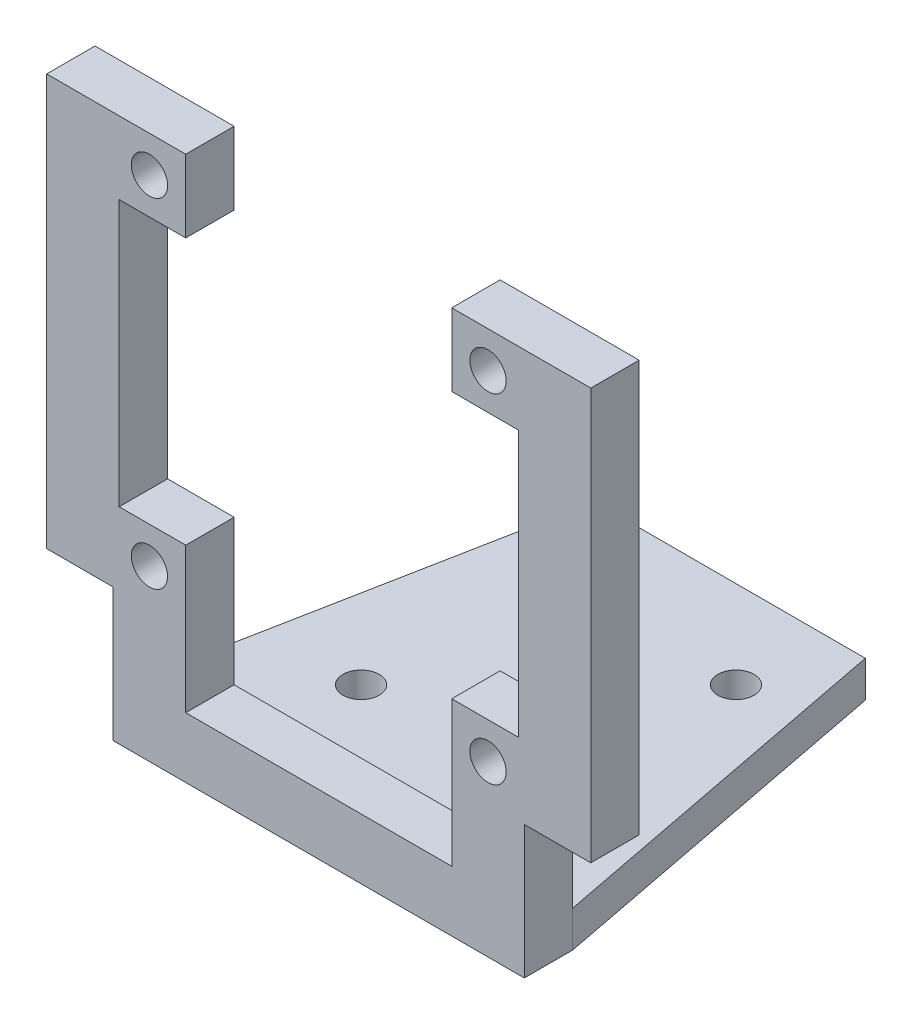
ISO-10303-21;
HEADER;
FILE_DESCRIPTION(('STEP AP214'),'2;1');
FILE_NAME('part.step','',(''),(''),'','','');
FILE_SCHEMA(('AUTOMOTIVE_DESIGN { 1 0 10303 214 1 1 1 1 }'));
ENDSEC;
DATA;
#1=APPLICATION_CONTEXT('core data for automotive mechanical design processes');
#2=APPLICATION_PROTOCOL_DEFINITION('international standard','automotive_design',2000,#1);
#3=PRODUCT_CONTEXT('',#1,'mechanical');
#4=PRODUCT('Part','Part','',(#3));
#5=PRODUCT_RELATED_PRODUCT_CATEGORY('part','',(#4));
#6=PRODUCT_DEFINITION_FORMATION('','',#4);
#7=PRODUCT_DEFINITION_CONTEXT('part definition',#1,'design');
#8=PRODUCT_DEFINITION('design','',#6,#7);
#9=PRODUCT_DEFINITION_SHAPE('','',#8);
#10=(LENGTH_UNIT() NAMED_UNIT(*) SI_UNIT(.MILLI.,.METRE.));
#11=(NAMED_UNIT(*) PLANE_ANGLE_UNIT() SI_UNIT($,.RADIAN.));
#12=(NAMED_UNIT(*) SI_UNIT($,.STERADIAN.) SOLID_ANGLE_UNIT());
#13=UNCERTAINTY_MEASURE_WITH_UNIT(LENGTH_MEASURE(1.E-05),#10,'distance_accuracy_value','');
#14=(GEOMETRIC_REPRESENTATION_CONTEXT(3) GLOBAL_UNCERTAINTY_ASSIGNED_CONTEXT((#13)) GLOBAL_UNIT_ASSIGNED_CONTEXT((#10,
#11,#12)) REPRESENTATION_CONTEXT('',''));
#15=CARTESIAN_POINT('',(0.,0.,0.));
#16=DIRECTION('',(0.,0.,1.));
#17=DIRECTION('',(1.,0.,0.));
#18=AXIS2_PLACEMENT_3D('',#15,#16,#17);
#19=CARTESIAN_POINT('',(0.,0.,0.));
#20=DIRECTION('',(0.,0.,1.));
#21=DIRECTION('',(1.,0.,0.));
#22=AXIS2_PLACEMENT_3D('',#19,#20,#21);
#23=PLANE('',#22);
#24=CARTESIAN_POINT('',(-14.,14.,0.));
#25=DIRECTION('',(0.,0.,1.));
#26=DIRECTION('',(1.,0.,0.));
#27=AXIS2_PLACEMENT_3D('',#24,#25,#26);
#28=CIRCLE('',#27,1.5);
#29=CARTESIAN_POINT('',(-12.5,14.,0.));
#30=VERTEX_POINT('',#29);
#31=EDGE_CURVE('E284',#30,#30,#28,.T.);
#32=ORIENTED_EDGE('',*,*,#31,.T.);
#33=EDGE_LOOP('',(#32));
#34=FACE_BOUND('',#33,.T.);
#35=CARTESIAN_POINT('',(14.,14.,0.));
#36=DIRECTION('',(0.,0.,1.));
#37=DIRECTION('',(1.,0.,0.));
#38=AXIS2_PLACEMENT_3D('',#35,#36,#37);
#39=CIRCLE('',#38,1.5);
#40=CARTESIAN_POINT('',(15.5,14.,0.));
#41=VERTEX_POINT('',#40);
#42=EDGE_CURVE('E290',#41,#41,#39,.T.);
#43=ORIENTED_EDGE('',*,*,#42,.T.);
#44=EDGE_LOOP('',(#43));
#45=FACE_BOUND('',#44,.T.);
#46=CARTESIAN_POINT('',(14.,-14.,0.));
#47=DIRECTION('',(0.,0.,1.));
#48=DIRECTION('',(1.,0.,0.));
#49=AXIS2_PLACEMENT_3D('',#46,#47,#48);
#50=CIRCLE('',#49,1.5);
#51=CARTESIAN_POINT('',(15.5,-14.,0.));
#52=VERTEX_POINT('',#51);
#53=EDGE_CURVE('E296',#52,#52,#50,.T.);
#54=ORIENTED_EDGE('',*,*,#53,.T.);
#55=EDGE_LOOP('',(#54));
#56=FACE_BOUND('',#55,.T.);
#57=CARTESIAN_POINT('',(-14.,-14.,0.));
#58=DIRECTION('',(0.,0.,1.));
#59=DIRECTION('',(1.,0.,0.));
#60=AXIS2_PLACEMENT_3D('',#57,#58,#59);
#61=CIRCLE('',#60,1.5);
#62=CARTESIAN_POINT('',(-12.5,-14.,0.));
#63=VERTEX_POINT('',#62);
#64=EDGE_CURVE('E302',#63,#63,#61,.T.);
#65=ORIENTED_EDGE('',*,*,#64,.T.);
#66=EDGE_LOOP('',(#65));
#67=FACE_BOUND('',#66,.T.);
#68=DIRECTION('',(-1.,0.,0.));
#69=VECTOR('',#68,1.);
#70=CARTESIAN_POINT('',(0.,-11.,0.));
#71=LINE('',#70,#69);
#72=CARTESIAN_POINT('',(-11.,-11.,0.));
#73=VERTEX_POINT('',#72);
#74=CARTESIAN_POINT('',(-16.5,-11.,0.));
#75=VERTEX_POINT('',#74);
#76=EDGE_CURVE('E411',#73,#75,#71,.T.);
#77=ORIENTED_EDGE('',*,*,#76,.F.);
#78=DIRECTION('',(0.,1.,0.));
#79=VECTOR('',#78,1.);
#80=CARTESIAN_POINT('',(-11.,17.,0.));
#81=LINE('',#80,#79);
#82=CARTESIAN_POINT('',(-11.,-23.,0.));
#83=VERTEX_POINT('',#82);
#84=EDGE_CURVE('E230',#83,#73,#81,.T.);
#85=ORIENTED_EDGE('',*,*,#84,.F.);
#86=DIRECTION('',(-1.,0.,0.));
#87=VECTOR('',#86,1.);
#88=CARTESIAN_POINT('',(-11.,-23.,0.));
#89=LINE('',#88,#87);
#90=CARTESIAN_POINT('',(11.,-23.,0.));
#91=VERTEX_POINT('',#90);
#92=EDGE_CURVE('E227',#91,#83,#89,.T.);
#93=ORIENTED_EDGE('',*,*,#92,.F.);
#94=DIRECTION('',(0.,-1.,0.));
#95=VECTOR('',#94,1.);
#96=CARTESIAN_POINT('',(11.,17.,0.));
#97=LINE('',#96,#95);
#98=CARTESIAN_POINT('',(11.,-11.,0.));
#99=VERTEX_POINT('',#98);
#100=EDGE_CURVE('E223',#99,#91,#97,.T.);
#101=ORIENTED_EDGE('',*,*,#100,.F.);
#102=DIRECTION('',(1.,0.,0.));
#103=VECTOR('',#102,1.);
#104=CARTESIAN_POINT('',(0.,-11.,0.));
#105=LINE('',#104,#103);
#106=CARTESIAN_POINT('',(16.5,-11.,0.));
#107=VERTEX_POINT('',#106);
#108=EDGE_CURVE('E377',#99,#107,#105,.T.);
#109=ORIENTED_EDGE('',*,*,#108,.T.);
#110=DIRECTION('',(0.,1.,0.));
#111=VECTOR('',#110,1.);
#112=CARTESIAN_POINT('',(16.5,0.,0.));
#113=LINE('',#112,#111);
#114=CARTESIAN_POINT('',(16.5,11.,0.));
#115=VERTEX_POINT('',#114);
#116=EDGE_CURVE('E371',#107,#115,#113,.T.);
#117=ORIENTED_EDGE('',*,*,#116,.T.);
#118=DIRECTION('',(-1.,0.,0.));
#119=VECTOR('',#118,1.);
#120=CARTESIAN_POINT('',(0.,11.,0.));
#121=LINE('',#120,#119);
#122=CARTESIAN_POINT('',(11.,11.,0.));
#123=VERTEX_POINT('',#122);
#124=EDGE_CURVE('E375',#115,#123,#121,.T.);
#125=ORIENTED_EDGE('',*,*,#124,.T.);
#126=CARTESIAN_POINT('',(11.,17.,0.));
#127=VERTEX_POINT('',#126);
#128=EDGE_CURVE('E224',#127,#123,#97,.T.);
#129=ORIENTED_EDGE('',*,*,#128,.F.);
#130=DIRECTION('',(-1.,0.,0.));
#131=VECTOR('',#130,1.);
#132=CARTESIAN_POINT('',(11.,17.,0.));
#133=LINE('',#132,#131);
#134=CARTESIAN_POINT('',(22.5,17.,0.));
#135=VERTEX_POINT('',#134);
#136=EDGE_CURVE('E221',#135,#127,#133,.T.);
#137=ORIENTED_EDGE('',*,*,#136,.F.);
#138=DIRECTION('',(0.,-1.,0.));
#139=VECTOR('',#138,1.);
#140=CARTESIAN_POINT('',(22.5,17.,0.));
#141=LINE('',#140,#139);
#142=CARTESIAN_POINT('',(22.5,-17.,0.));
#143=VERTEX_POINT('',#142);
#144=EDGE_CURVE('E357',#135,#143,#141,.T.);
#145=ORIENTED_EDGE('',*,*,#144,.T.);
#146=DIRECTION('',(-1.,0.,0.));
#147=VECTOR('',#146,1.);
#148=CARTESIAN_POINT('',(17.,-17.,0.));
#149=LINE('',#148,#147);
#150=CARTESIAN_POINT('',(17.,-17.,0.));
#151=VERTEX_POINT('',#150);
#152=EDGE_CURVE('E355',#143,#151,#149,.T.);
#153=ORIENTED_EDGE('',*,*,#152,.T.);
#154=DIRECTION('',(0.,1.,0.));
#155=VECTOR('',#154,1.);
#156=CARTESIAN_POINT('',(17.,17.,0.));
#157=LINE('',#156,#155);
#158=CARTESIAN_POINT('',(17.,-25.,0.));
#159=VERTEX_POINT('',#158);
#160=EDGE_CURVE('E217',#159,#151,#157,.T.);
#161=ORIENTED_EDGE('',*,*,#160,.F.);
#162=DIRECTION('',(1.,0.,0.));
#163=VECTOR('',#162,1.);
#164=CARTESIAN_POINT('',(-17.,-25.,0.));
#165=LINE('',#164,#163);
#166=CARTESIAN_POINT('',(-17.,-25.,0.));
#167=VERTEX_POINT('',#166);
#168=EDGE_CURVE('E308',#167,#159,#165,.T.);
#169=ORIENTED_EDGE('',*,*,#168,.F.);
#170=DIRECTION('',(0.,-1.,0.));
#171=VECTOR('',#170,1.);
#172=CARTESIAN_POINT('',(-17.,17.,0.));
#173=LINE('',#172,#171);
#174=CARTESIAN_POINT('',(-17.,-17.,0.));
#175=VERTEX_POINT('',#174);
#176=EDGE_CURVE('E215',#175,#167,#173,.T.);
#177=ORIENTED_EDGE('',*,*,#176,.F.);
#178=DIRECTION('',(1.,0.,0.));
#179=VECTOR('',#178,1.);
#180=CARTESIAN_POINT('',(-17.,-17.,0.));
#181=LINE('',#180,#179);
#182=CARTESIAN_POINT('',(-22.5,-17.,0.));
#183=VERTEX_POINT('',#182);
#184=EDGE_CURVE('E391',#183,#175,#181,.T.);
#185=ORIENTED_EDGE('',*,*,#184,.F.);
#186=DIRECTION('',(0.,-1.,0.));
#187=VECTOR('',#186,1.);
#188=CARTESIAN_POINT('',(-22.5,17.,0.));
#189=LINE('',#188,#187);
#190=CARTESIAN_POINT('',(-22.5,17.,0.));
#191=VERTEX_POINT('',#190);
#192=EDGE_CURVE('E399',#191,#183,#189,.T.);
#193=ORIENTED_EDGE('',*,*,#192,.F.);
#194=DIRECTION('',(-1.,0.,0.));
#195=VECTOR('',#194,1.);
#196=CARTESIAN_POINT('',(-17.,17.,0.));
#197=LINE('',#196,#195);
#198=CARTESIAN_POINT('',(-11.,17.,0.));
#199=VERTEX_POINT('',#198);
#200=EDGE_CURVE('E233',#199,#191,#197,.T.);
#201=ORIENTED_EDGE('',*,*,#200,.F.);
#202=CARTESIAN_POINT('',(-11.,11.,0.));
#203=VERTEX_POINT('',#202);
#204=EDGE_CURVE('E229',#203,#199,#81,.T.);
#205=ORIENTED_EDGE('',*,*,#204,.F.);
#206=DIRECTION('',(1.,0.,0.));
#207=VECTOR('',#206,1.);
#208=CARTESIAN_POINT('',(0.,11.,0.));
#209=LINE('',#208,#207);
#210=CARTESIAN_POINT('',(-16.5,11.,0.));
#211=VERTEX_POINT('',#210);
#212=EDGE_CURVE('E47',#211,#203,#209,.T.);
#213=ORIENTED_EDGE('',*,*,#212,.F.);
#214=DIRECTION('',(0.,1.,0.));
#215=VECTOR('',#214,1.);
#216=CARTESIAN_POINT('',(-16.5,0.,0.));
#217=LINE('',#216,#215);
#218=EDGE_CURVE('E405',#75,#211,#217,.T.);
#219=ORIENTED_EDGE('',*,*,#218,.F.);
#220=EDGE_LOOP('',(#77,#85,#93,#101,#109,#117,#125,#129,#137,#145,#153,#161,#169,#177,#185,#193,
#201,#205,#213,#219));
#221=FACE_BOUND('',#220,.T.);
#222=ADVANCED_FACE('F32',(#34,#45,#56,#67,#221),#23,.F.);
#223=CARTESIAN_POINT('',(0.,0.,4.));
#224=DIRECTION('',(0.,0.,1.));
#225=DIRECTION('',(1.,0.,0.));
#226=AXIS2_PLACEMENT_3D('',#223,#224,#225);
#227=PLANE('',#226);
#228=CARTESIAN_POINT('',(14.,-14.,4.));
#229=DIRECTION('',(0.,0.,1.));
#230=DIRECTION('',(1.,0.,0.));
#231=AXIS2_PLACEMENT_3D('',#228,#229,#230);
#232=CIRCLE('',#231,1.5);
#233=CARTESIAN_POINT('',(15.5,-14.,4.));
#234=VERTEX_POINT('',#233);
#235=EDGE_CURVE('E293',#234,#234,#232,.T.);
#236=ORIENTED_EDGE('',*,*,#235,.F.);
#237=EDGE_LOOP('',(#236));
#238=FACE_BOUND('',#237,.T.);
#239=CARTESIAN_POINT('',(-14.,14.,4.));
#240=DIRECTION('',(0.,0.,1.));
#241=DIRECTION('',(1.,0.,0.));
#242=AXIS2_PLACEMENT_3D('',#239,#240,#241);
#243=CIRCLE('',#242,1.5);
#244=CARTESIAN_POINT('',(-12.5,14.,4.));
#245=VERTEX_POINT('',#244);
#246=EDGE_CURVE('E218',#245,#245,#243,.T.);
#247=ORIENTED_EDGE('',*,*,#246,.F.);
#248=EDGE_LOOP('',(#247));
#249=FACE_BOUND('',#248,.T.);
#250=CARTESIAN_POINT('',(14.,14.,4.));
#251=DIRECTION('',(0.,0.,1.));
#252=DIRECTION('',(1.,0.,0.));
#253=AXIS2_PLACEMENT_3D('',#250,#251,#252);
#254=CIRCLE('',#253,1.5);
#255=CARTESIAN_POINT('',(15.5,14.,4.));
#256=VERTEX_POINT('',#255);
#257=EDGE_CURVE('E287',#256,#256,#254,.T.);
#258=ORIENTED_EDGE('',*,*,#257,.F.);
#259=EDGE_LOOP('',(#258));
#260=FACE_BOUND('',#259,.T.);
#261=CARTESIAN_POINT('',(-14.,-14.,4.));
#262=DIRECTION('',(0.,0.,1.));
#263=DIRECTION('',(1.,0.,0.));
#264=AXIS2_PLACEMENT_3D('',#261,#262,#263);
#265=CIRCLE('',#264,1.5);
#266=CARTESIAN_POINT('',(-12.5,-14.,4.));
#267=VERTEX_POINT('',#266);
#268=EDGE_CURVE('E299',#267,#267,#265,.T.);
#269=ORIENTED_EDGE('',*,*,#268,.F.);
#270=EDGE_LOOP('',(#269));
#271=FACE_BOUND('',#270,.T.);
#272=DIRECTION('',(0.,1.,0.));
#273=VECTOR('',#272,1.);
#274=CARTESIAN_POINT('',(-11.,17.,4.));
#275=LINE('',#274,#273);
#276=CARTESIAN_POINT('',(-11.,-23.,4.));
#277=VERTEX_POINT('',#276);
#278=CARTESIAN_POINT('',(-11.,-11.,4.));
#279=VERTEX_POINT('',#278);
#280=EDGE_CURVE('E206',#277,#279,#275,.T.);
#281=ORIENTED_EDGE('',*,*,#280,.T.);
#282=DIRECTION('',(-1.,0.,0.));
#283=VECTOR('',#282,1.);
#284=CARTESIAN_POINT('',(-11.,-11.,4.));
#285=LINE('',#284,#283);
#286=CARTESIAN_POINT('',(-16.5,-11.,4.));
#287=VERTEX_POINT('',#286);
#288=EDGE_CURVE('E417',#279,#287,#285,.T.);
#289=ORIENTED_EDGE('',*,*,#288,.T.);
#290=DIRECTION('',(0.,1.,0.));
#291=VECTOR('',#290,1.);
#292=CARTESIAN_POINT('',(-16.5,11.,4.));
#293=LINE('',#292,#291);
#294=CARTESIAN_POINT('',(-16.5,11.,4.));
#295=VERTEX_POINT('',#294);
#296=EDGE_CURVE('E200',#287,#295,#293,.T.);
#297=ORIENTED_EDGE('',*,*,#296,.T.);
#298=DIRECTION('',(1.,0.,0.));
#299=VECTOR('',#298,1.);
#300=CARTESIAN_POINT('',(-11.,11.,4.));
#301=LINE('',#300,#299);
#302=CARTESIAN_POINT('',(-11.,11.,4.));
#303=VERTEX_POINT('',#302);
#304=EDGE_CURVE('E187',#295,#303,#301,.T.);
#305=ORIENTED_EDGE('',*,*,#304,.T.);
#306=CARTESIAN_POINT('',(-11.,17.,4.));
#307=VERTEX_POINT('',#306);
#308=EDGE_CURVE('E196',#303,#307,#275,.T.);
#309=ORIENTED_EDGE('',*,*,#308,.T.);
#310=DIRECTION('',(-1.,0.,0.));
#311=VECTOR('',#310,1.);
#312=CARTESIAN_POINT('',(-17.,17.,4.));
#313=LINE('',#312,#311);
#314=CARTESIAN_POINT('',(-22.5,17.,4.));
#315=VERTEX_POINT('',#314);
#316=EDGE_CURVE('E209',#307,#315,#313,.T.);
#317=ORIENTED_EDGE('',*,*,#316,.T.);
#318=DIRECTION('',(0.,1.,0.));
#319=VECTOR('',#318,1.);
#320=CARTESIAN_POINT('',(-22.5,17.,4.));
#321=LINE('',#320,#319);
#322=CARTESIAN_POINT('',(-22.5,-17.,4.));
#323=VERTEX_POINT('',#322);
#324=EDGE_CURVE('E402',#323,#315,#321,.T.);
#325=ORIENTED_EDGE('',*,*,#324,.F.);
#326=DIRECTION('',(-1.,0.,0.));
#327=VECTOR('',#326,1.);
#328=CARTESIAN_POINT('',(-17.,-17.,4.));
#329=LINE('',#328,#327);
#330=CARTESIAN_POINT('',(-17.,-17.,4.));
#331=VERTEX_POINT('',#330);
#332=EDGE_CURVE('E396',#331,#323,#329,.T.);
#333=ORIENTED_EDGE('',*,*,#332,.F.);
#334=DIRECTION('',(0.,-1.,0.));
#335=VECTOR('',#334,1.);
#336=CARTESIAN_POINT('',(-17.,17.,4.));
#337=LINE('',#336,#335);
#338=CARTESIAN_POINT('',(-17.,-28.,4.));
#339=VERTEX_POINT('',#338);
#340=EDGE_CURVE('E235',#331,#339,#337,.T.);
#341=ORIENTED_EDGE('',*,*,#340,.T.);
#342=DIRECTION('',(1.,0.,0.));
#343=VECTOR('',#342,1.);
#344=CARTESIAN_POINT('',(-17.,-28.,4.));
#345=LINE('',#344,#343);
#346=CARTESIAN_POINT('',(17.,-28.,4.));
#347=VERTEX_POINT('',#346);
#348=EDGE_CURVE('E281',#339,#347,#345,.T.);
#349=ORIENTED_EDGE('',*,*,#348,.T.);
#350=DIRECTION('',(0.,1.,0.));
#351=VECTOR('',#350,1.);
#352=CARTESIAN_POINT('',(17.,17.,4.));
#353=LINE('',#352,#351);
#354=CARTESIAN_POINT('',(17.,-17.,4.));
#355=VERTEX_POINT('',#354);
#356=EDGE_CURVE('E278',#347,#355,#353,.T.);
#357=ORIENTED_EDGE('',*,*,#356,.T.);
#358=DIRECTION('',(1.,0.,0.));
#359=VECTOR('',#358,1.);
#360=CARTESIAN_POINT('',(17.,-17.,4.));
#361=LINE('',#360,#359);
#362=CARTESIAN_POINT('',(22.5,-17.,4.));
#363=VERTEX_POINT('',#362);
#364=EDGE_CURVE('E368',#355,#363,#361,.T.);
#365=ORIENTED_EDGE('',*,*,#364,.T.);
#366=DIRECTION('',(0.,1.,0.));
#367=VECTOR('',#366,1.);
#368=CARTESIAN_POINT('',(22.5,17.,4.));
#369=LINE('',#368,#367);
#370=CARTESIAN_POINT('',(22.5,17.,4.));
#371=VERTEX_POINT('',#370);
#372=EDGE_CURVE('E362',#363,#371,#369,.T.);
#373=ORIENTED_EDGE('',*,*,#372,.T.);
#374=DIRECTION('',(-1.,0.,0.));
#375=VECTOR('',#374,1.);
#376=CARTESIAN_POINT('',(11.,17.,4.));
#377=LINE('',#376,#375);
#378=CARTESIAN_POINT('',(11.,17.,4.));
#379=VERTEX_POINT('',#378);
#380=EDGE_CURVE('E273',#371,#379,#377,.T.);
#381=ORIENTED_EDGE('',*,*,#380,.T.);
#382=DIRECTION('',(0.,-1.,0.));
#383=VECTOR('',#382,1.);
#384=CARTESIAN_POINT('',(11.,17.,4.));
#385=LINE('',#384,#383);
#386=CARTESIAN_POINT('',(11.,11.,4.));
#387=VERTEX_POINT('',#386);
#388=EDGE_CURVE('E210',#379,#387,#385,.T.);
#389=ORIENTED_EDGE('',*,*,#388,.T.);
#390=DIRECTION('',(-1.,0.,0.));
#391=VECTOR('',#390,1.);
#392=CARTESIAN_POINT('',(11.,11.,4.));
#393=LINE('',#392,#391);
#394=CARTESIAN_POINT('',(16.5,11.,4.));
#395=VERTEX_POINT('',#394);
#396=EDGE_CURVE('E271',#395,#387,#393,.T.);
#397=ORIENTED_EDGE('',*,*,#396,.F.);
#398=DIRECTION('',(0.,1.,0.));
#399=VECTOR('',#398,1.);
#400=CARTESIAN_POINT('',(16.5,11.,4.));
#401=LINE('',#400,#399);
#402=CARTESIAN_POINT('',(16.5,-11.,4.));
#403=VERTEX_POINT('',#402);
#404=EDGE_CURVE('E385',#403,#395,#401,.T.);
#405=ORIENTED_EDGE('',*,*,#404,.F.);
#406=DIRECTION('',(1.,0.,0.));
#407=VECTOR('',#406,1.);
#408=CARTESIAN_POINT('',(11.,-11.,4.));
#409=LINE('',#408,#407);
#410=CARTESIAN_POINT('',(11.,-11.,4.));
#411=VERTEX_POINT('',#410);
#412=EDGE_CURVE('E388',#411,#403,#409,.T.);
#413=ORIENTED_EDGE('',*,*,#412,.F.);
#414=CARTESIAN_POINT('',(11.,-23.,4.));
#415=VERTEX_POINT('',#414);
#416=EDGE_CURVE('E275',#411,#415,#385,.T.);
#417=ORIENTED_EDGE('',*,*,#416,.T.);
#418=DIRECTION('',(-1.,0.,0.));
#419=VECTOR('',#418,1.);
#420=CARTESIAN_POINT('',(-11.,-23.,4.));
#421=LINE('',#420,#419);
#422=EDGE_CURVE('E207',#415,#277,#421,.T.);
#423=ORIENTED_EDGE('',*,*,#422,.T.);
#424=EDGE_LOOP('',(#281,#289,#297,#305,#309,#317,#325,#333,#341,#349,#357,#365,#373,#381,#389,
#397,#405,#413,#417,#423));
#425=FACE_BOUND('',#424,.T.);
#426=ADVANCED_FACE('F195',(#238,#249,#260,#271,#425),#227,.T.);
#427=CARTESIAN_POINT('',(-11.,17.,4.));
#428=DIRECTION('',(-1.,0.,0.));
#429=DIRECTION('',(0.,-1.,0.));
#430=AXIS2_PLACEMENT_3D('',#427,#428,#429);
#431=PLANE('',#430);
#432=DIRECTION('',(0.,0.,-1.));
#433=VECTOR('',#432,1.);
#434=CARTESIAN_POINT('',(-11.,-11.,4.));
#435=LINE('',#434,#433);
#436=EDGE_CURVE('E11',#279,#73,#435,.T.);
#437=ORIENTED_EDGE('',*,*,#436,.F.);
#438=ORIENTED_EDGE('',*,*,#280,.F.);
#439=DIRECTION('',(0.,0.,-1.));
#440=VECTOR('',#439,1.);
#441=CARTESIAN_POINT('',(-11.,-23.,4.));
#442=LINE('',#441,#440);
#443=EDGE_CURVE('E237',#277,#83,#442,.T.);
#444=ORIENTED_EDGE('',*,*,#443,.T.);
#445=ORIENTED_EDGE('',*,*,#84,.T.);
#446=EDGE_LOOP('',(#437,#438,#444,#445));
#447=FACE_BOUND('',#446,.T.);
#448=ADVANCED_FACE('F427',(#447),#431,.F.);
#449=DIRECTION('',(0.,0.,1.));
#450=VECTOR('',#449,1.);
#451=CARTESIAN_POINT('',(-11.,11.,4.));
#452=LINE('',#451,#450);
#453=EDGE_CURVE('E40',#203,#303,#452,.T.);
#454=ORIENTED_EDGE('',*,*,#453,.F.);
#455=ORIENTED_EDGE('',*,*,#204,.T.);
#456=DIRECTION('',(0.,0.,-1.));
#457=VECTOR('',#456,1.);
#458=CARTESIAN_POINT('',(-11.,17.,4.));
#459=LINE('',#458,#457);
#460=EDGE_CURVE('E204',#307,#199,#459,.T.);
#461=ORIENTED_EDGE('',*,*,#460,.F.);
#462=ORIENTED_EDGE('',*,*,#308,.F.);
#463=EDGE_LOOP('',(#454,#455,#461,#462));
#464=FACE_BOUND('',#463,.T.);
#465=ADVANCED_FACE('F202',(#464),#431,.F.);
#466=CARTESIAN_POINT('',(-17.,17.,4.));
#467=DIRECTION('',(1.,0.,0.));
#468=DIRECTION('',(0.,1.,0.));
#469=AXIS2_PLACEMENT_3D('',#466,#467,#468);
#470=PLANE('',#469);
#471=DIRECTION('',(0.,0.,1.));
#472=VECTOR('',#471,1.);
#473=CARTESIAN_POINT('',(-17.,-17.,-34.441980198589));
#474=LINE('',#473,#472);
#475=EDGE_CURVE('E55',#175,#331,#474,.T.);
#476=ORIENTED_EDGE('',*,*,#475,.F.);
#477=ORIENTED_EDGE('',*,*,#176,.T.);
#478=DIRECTION('',(0.,1.,0.));
#479=VECTOR('',#478,1.);
#480=CARTESIAN_POINT('',(-17.,-56.,0.));
#481=LINE('',#480,#479);
#482=CARTESIAN_POINT('',(-17.,-28.,0.));
#483=VERTEX_POINT('',#482);
#484=EDGE_CURVE('E349',#483,#167,#481,.T.);
#485=ORIENTED_EDGE('',*,*,#484,.F.);
#486=DIRECTION('',(0.,0.,-1.));
#487=VECTOR('',#486,1.);
#488=CARTESIAN_POINT('',(-17.,-28.,4.));
#489=LINE('',#488,#487);
#490=EDGE_CURVE('E249',#339,#483,#489,.T.);
#491=ORIENTED_EDGE('',*,*,#490,.F.);
#492=ORIENTED_EDGE('',*,*,#340,.F.);
#493=EDGE_LOOP('',(#476,#477,#485,#491,#492));
#494=FACE_BOUND('',#493,.T.);
#495=ADVANCED_FACE('F34',(#494),#470,.F.);
#496=CARTESIAN_POINT('',(11.,17.,4.));
#497=DIRECTION('',(1.,0.,0.));
#498=DIRECTION('',(0.,1.,0.));
#499=AXIS2_PLACEMENT_3D('',#496,#497,#498);
#500=PLANE('',#499);
#501=ORIENTED_EDGE('',*,*,#128,.T.);
#502=DIRECTION('',(0.,0.,1.));
#503=VECTOR('',#502,1.);
#504=CARTESIAN_POINT('',(11.,11.,4.));
#505=LINE('',#504,#503);
#506=EDGE_CURVE('E192',#123,#387,#505,.T.);
#507=ORIENTED_EDGE('',*,*,#506,.T.);
#508=ORIENTED_EDGE('',*,*,#388,.F.);
#509=DIRECTION('',(0.,0.,-1.));
#510=VECTOR('',#509,1.);
#511=CARTESIAN_POINT('',(11.,17.,4.));
#512=LINE('',#511,#510);
#513=EDGE_CURVE('E243',#379,#127,#512,.T.);
#514=ORIENTED_EDGE('',*,*,#513,.T.);
#515=EDGE_LOOP('',(#501,#507,#508,#514));
#516=FACE_BOUND('',#515,.T.);
#517=ADVANCED_FACE('F265',(#516),#500,.F.);
#518=CARTESIAN_POINT('',(-17.,-28.,4.));
#519=DIRECTION('',(0.,1.,0.));
#520=DIRECTION('',(0.,0.,1.));
#521=AXIS2_PLACEMENT_3D('',#518,#519,#520);
#522=PLANE('',#521);
#523=CARTESIAN_POINT('',(7.74999999999999,-28.,-22.75));
#524=DIRECTION('',(0.,1.,0.));
#525=DIRECTION('',(0.,0.,1.));
#526=AXIS2_PLACEMENT_3D('',#523,#524,#525);
#527=CIRCLE('',#526,1.5);
#528=CARTESIAN_POINT('',(7.74999999999999,-28.,-21.25));
#529=VERTEX_POINT('',#528);
#530=EDGE_CURVE('E312',#529,#529,#527,.T.);
#531=ORIENTED_EDGE('',*,*,#530,.T.);
#532=EDGE_LOOP('',(#531));
#533=FACE_BOUND('',#532,.T.);
#534=CARTESIAN_POINT('',(7.74999999999997,-28.,-7.24999999999998));
#535=DIRECTION('',(0.,1.,0.));
#536=DIRECTION('',(0.,0.,1.));
#537=AXIS2_PLACEMENT_3D('',#534,#535,#536);
#538=CIRCLE('',#537,1.5);
#539=CARTESIAN_POINT('',(7.74999999999997,-28.,-5.74999999999998));
#540=VERTEX_POINT('',#539);
#541=EDGE_CURVE('E321',#540,#540,#538,.T.);
#542=ORIENTED_EDGE('',*,*,#541,.T.);
#543=EDGE_LOOP('',(#542));
#544=FACE_BOUND('',#543,.T.);
#545=CARTESIAN_POINT('',(-7.74999999999999,-28.,-7.25));
#546=DIRECTION('',(0.,1.,0.));
#547=DIRECTION('',(0.,0.,1.));
#548=AXIS2_PLACEMENT_3D('',#545,#546,#547);
#549=CIRCLE('',#548,1.5);
#550=CARTESIAN_POINT('',(-7.74999999999999,-28.,-5.75));
#551=VERTEX_POINT('',#550);
#552=EDGE_CURVE('E327',#551,#551,#549,.T.);
#553=ORIENTED_EDGE('',*,*,#552,.T.);
#554=EDGE_LOOP('',(#553));
#555=FACE_BOUND('',#554,.T.);
#556=CARTESIAN_POINT('',(-7.74999999999992,-28.,-22.7500000000001));
#557=DIRECTION('',(0.,1.,0.));
#558=DIRECTION('',(0.,0.,1.));
#559=AXIS2_PLACEMENT_3D('',#556,#557,#558);
#560=CIRCLE('',#559,1.5);
#561=CARTESIAN_POINT('',(-7.74999999999992,-28.,-21.2500000000001));
#562=VERTEX_POINT('',#561);
#563=EDGE_CURVE('E333',#562,#562,#560,.T.);
#564=ORIENTED_EDGE('',*,*,#563,.T.);
#565=EDGE_LOOP('',(#564));
#566=FACE_BOUND('',#565,.T.);
#567=DIRECTION('',(-0.189735094838744,0.,0.981835319076744));
#568=VECTOR('',#567,1.);
#569=CARTESIAN_POINT('',(-17.7451544695242,-28.,3.85600237514613));
#570=LINE('',#569,#568);
#571=CARTESIAN_POINT('',(-11.2026399595048,-28.,-30.));
#572=VERTEX_POINT('',#571);
#573=EDGE_CURVE('E347',#572,#483,#570,.T.);
#574=ORIENTED_EDGE('',*,*,#573,.F.);
#575=DIRECTION('',(-1.,0.,0.));
#576=VECTOR('',#575,1.);
#577=CARTESIAN_POINT('',(-17.,-28.,-30.));
#578=LINE('',#577,#576);
#579=CARTESIAN_POINT('',(11.2026399595048,-28.,-30.));
#580=VERTEX_POINT('',#579);
#581=EDGE_CURVE('E305',#580,#572,#578,.T.);
#582=ORIENTED_EDGE('',*,*,#581,.F.);
#583=DIRECTION('',(0.189735094838744,0.,0.981835319076744));
#584=VECTOR('',#583,1.);
#585=CARTESIAN_POINT('',(16.5211746582663,-28.,-2.47781061580974));
#586=LINE('',#585,#584);
#587=CARTESIAN_POINT('',(17.,-28.,0.));
#588=VERTEX_POINT('',#587);
#589=EDGE_CURVE('E339',#580,#588,#586,.T.);
#590=ORIENTED_EDGE('',*,*,#589,.T.);
#591=DIRECTION('',(0.,0.,-1.));
#592=VECTOR('',#591,1.);
#593=CARTESIAN_POINT('',(17.,-28.,4.));
#594=LINE('',#593,#592);
#595=EDGE_CURVE('E246',#347,#588,#594,.T.);
#596=ORIENTED_EDGE('',*,*,#595,.F.);
#597=ORIENTED_EDGE('',*,*,#348,.F.);
#598=ORIENTED_EDGE('',*,*,#490,.T.);
#599=EDGE_LOOP('',(#574,#582,#590,#596,#597,#598));
#600=FACE_BOUND('',#599,.T.);
#601=ADVANCED_FACE('F467',(#533,#544,#555,#566,#600),#522,.F.);
#602=CARTESIAN_POINT('',(-17.,-25.,-30.));
#603=DIRECTION('',(0.,-1.,0.));
#604=DIRECTION('',(1.,0.,0.));
#605=AXIS2_PLACEMENT_3D('',#602,#603,#604);
#606=PLANE('',#605);
#607=CARTESIAN_POINT('',(7.74999999999999,-25.,-22.75));
#608=DIRECTION('',(0.,1.,0.));
#609=DIRECTION('',(0.,0.,1.));
#610=AXIS2_PLACEMENT_3D('',#607,#608,#609);
#611=CIRCLE('',#610,1.5);
#612=CARTESIAN_POINT('',(7.74999999999999,-25.,-21.25));
#613=VERTEX_POINT('',#612);
#614=EDGE_CURVE('E318',#613,#613,#611,.T.);
#615=ORIENTED_EDGE('',*,*,#614,.F.);
#616=EDGE_LOOP('',(#615));
#617=FACE_BOUND('',#616,.T.);
#618=CARTESIAN_POINT('',(7.74999999999997,-25.,-7.24999999999998));
#619=DIRECTION('',(0.,1.,0.));
#620=DIRECTION('',(0.,0.,1.));
#621=AXIS2_PLACEMENT_3D('',#618,#619,#620);
#622=CIRCLE('',#621,1.5);
#623=CARTESIAN_POINT('',(7.74999999999997,-25.,-5.74999999999998));
#624=VERTEX_POINT('',#623);
#625=EDGE_CURVE('E324',#624,#624,#622,.T.);
#626=ORIENTED_EDGE('',*,*,#625,.F.);
#627=EDGE_LOOP('',(#626));
#628=FACE_BOUND('',#627,.T.);
#629=CARTESIAN_POINT('',(-7.74999999999999,-25.,-7.25));
#630=DIRECTION('',(0.,1.,0.));
#631=DIRECTION('',(0.,0.,1.));
#632=AXIS2_PLACEMENT_3D('',#629,#630,#631);
#633=CIRCLE('',#632,1.5);
#634=CARTESIAN_POINT('',(-7.74999999999999,-25.,-5.75));
#635=VERTEX_POINT('',#634);
#636=EDGE_CURVE('E330',#635,#635,#633,.T.);
#637=ORIENTED_EDGE('',*,*,#636,.F.);
#638=EDGE_LOOP('',(#637));
#639=FACE_BOUND('',#638,.T.);
#640=CARTESIAN_POINT('',(-7.74999999999992,-25.,-22.7500000000001));
#641=DIRECTION('',(0.,1.,0.));
#642=DIRECTION('',(0.,0.,1.));
#643=AXIS2_PLACEMENT_3D('',#640,#641,#642);
#644=CIRCLE('',#643,1.5);
#645=CARTESIAN_POINT('',(-7.74999999999992,-25.,-21.2500000000001));
#646=VERTEX_POINT('',#645);
#647=EDGE_CURVE('E336',#646,#646,#644,.T.);
#648=ORIENTED_EDGE('',*,*,#647,.F.);
#649=EDGE_LOOP('',(#648));
#650=FACE_BOUND('',#649,.T.);
#651=DIRECTION('',(-0.189735094838744,0.,0.981835319076744));
#652=VECTOR('',#651,1.);
#653=CARTESIAN_POINT('',(-17.,-25.,0.));
#654=LINE('',#653,#652);
#655=CARTESIAN_POINT('',(-11.2026399595048,-25.,-30.));
#656=VERTEX_POINT('',#655);
#657=EDGE_CURVE('E352',#656,#167,#654,.T.);
#658=ORIENTED_EDGE('',*,*,#657,.T.);
#659=ORIENTED_EDGE('',*,*,#168,.T.);
#660=DIRECTION('',(0.189735094838744,0.,0.981835319076744));
#661=VECTOR('',#660,1.);
#662=CARTESIAN_POINT('',(17.,-25.,0.));
#663=LINE('',#662,#661);
#664=CARTESIAN_POINT('',(11.2026399595048,-25.,-30.));
#665=VERTEX_POINT('',#664);
#666=EDGE_CURVE('E345',#665,#159,#663,.T.);
#667=ORIENTED_EDGE('',*,*,#666,.F.);
#668=DIRECTION('',(1.,0.,0.));
#669=VECTOR('',#668,1.);
#670=CARTESIAN_POINT('',(-17.,-25.,-30.));
#671=LINE('',#670,#669);
#672=EDGE_CURVE('E311',#656,#665,#671,.T.);
#673=ORIENTED_EDGE('',*,*,#672,.F.);
#674=EDGE_LOOP('',(#658,#659,#667,#673));
#675=FACE_BOUND('',#674,.T.);
#676=ADVANCED_FACE('F457',(#617,#628,#639,#650,#675),#606,.F.);
#677=CARTESIAN_POINT('',(0.,0.,-30.));
#678=DIRECTION('',(0.,0.,-1.));
#679=DIRECTION('',(-1.,0.,0.));
#680=AXIS2_PLACEMENT_3D('',#677,#678,#679);
#681=PLANE('',#680);
#682=ORIENTED_EDGE('',*,*,#581,.T.);
#683=DIRECTION('',(0.,1.,0.));
#684=VECTOR('',#683,1.);
#685=CARTESIAN_POINT('',(-11.2026399595048,0.,-30.));
#686=LINE('',#685,#684);
#687=EDGE_CURVE('E255',#572,#656,#686,.T.);
#688=ORIENTED_EDGE('',*,*,#687,.T.);
#689=ORIENTED_EDGE('',*,*,#672,.T.);
#690=DIRECTION('',(0.,1.,0.));
#691=VECTOR('',#690,1.);
#692=CARTESIAN_POINT('',(11.2026399595048,0.,-30.));
#693=LINE('',#692,#691);
#694=EDGE_CURVE('E252',#580,#665,#693,.T.);
#695=ORIENTED_EDGE('',*,*,#694,.F.);
#696=EDGE_LOOP('',(#682,#688,#689,#695));
#697=FACE_BOUND('',#696,.T.);
#698=ADVANCED_FACE('F461',(#697),#681,.T.);
#699=CARTESIAN_POINT('',(17.,17.,4.));
#700=DIRECTION('',(-1.,0.,0.));
#701=DIRECTION('',(0.,-1.,0.));
#702=AXIS2_PLACEMENT_3D('',#699,#700,#701);
#703=PLANE('',#702);
#704=ORIENTED_EDGE('',*,*,#160,.T.);
#705=DIRECTION('',(0.,0.,1.));
#706=VECTOR('',#705,1.);
#707=CARTESIAN_POINT('',(17.,-17.,-34.441980198589));
#708=LINE('',#707,#706);
#709=EDGE_CURVE('E358',#151,#355,#708,.T.);
#710=ORIENTED_EDGE('',*,*,#709,.T.);
#711=ORIENTED_EDGE('',*,*,#356,.F.);
#712=ORIENTED_EDGE('',*,*,#595,.T.);
#713=DIRECTION('',(0.,1.,0.));
#714=VECTOR('',#713,1.);
#715=CARTESIAN_POINT('',(17.,-56.,0.));
#716=LINE('',#715,#714);
#717=EDGE_CURVE('E342',#588,#159,#716,.T.);
#718=ORIENTED_EDGE('',*,*,#717,.T.);
#719=EDGE_LOOP('',(#704,#710,#711,#712,#718));
#720=FACE_BOUND('',#719,.T.);
#721=ADVANCED_FACE('F471',(#720),#703,.F.);
#722=CARTESIAN_POINT('',(11.,17.,4.));
#723=DIRECTION('',(0.,-1.,0.));
#724=DIRECTION('',(0.,0.,-1.));
#725=AXIS2_PLACEMENT_3D('',#722,#723,#724);
#726=PLANE('',#725);
#727=ORIENTED_EDGE('',*,*,#136,.T.);
#728=ORIENTED_EDGE('',*,*,#513,.F.);
#729=ORIENTED_EDGE('',*,*,#380,.F.);
#730=DIRECTION('',(0.,0.,1.));
#731=VECTOR('',#730,1.);
#732=CARTESIAN_POINT('',(22.5,17.,-34.441980198589));
#733=LINE('',#732,#731);
#734=EDGE_CURVE('E364',#135,#371,#733,.T.);
#735=ORIENTED_EDGE('',*,*,#734,.F.);
#736=EDGE_LOOP('',(#727,#728,#729,#735));
#737=FACE_BOUND('',#736,.T.);
#738=ADVANCED_FACE('F483',(#737),#726,.F.);
#739=ORIENTED_EDGE('',*,*,#416,.F.);
#740=DIRECTION('',(0.,0.,-1.));
#741=VECTOR('',#740,1.);
#742=CARTESIAN_POINT('',(11.,-11.,4.));
#743=LINE('',#742,#741);
#744=EDGE_CURVE('E258',#411,#99,#743,.T.);
#745=ORIENTED_EDGE('',*,*,#744,.T.);
#746=ORIENTED_EDGE('',*,*,#100,.T.);
#747=DIRECTION('',(0.,0.,-1.));
#748=VECTOR('',#747,1.);
#749=CARTESIAN_POINT('',(11.,-23.,4.));
#750=LINE('',#749,#748);
#751=EDGE_CURVE('E240',#415,#91,#750,.T.);
#752=ORIENTED_EDGE('',*,*,#751,.F.);
#753=EDGE_LOOP('',(#739,#745,#746,#752));
#754=FACE_BOUND('',#753,.T.);
#755=ADVANCED_FACE('F494',(#754),#500,.F.);
#756=CARTESIAN_POINT('',(-11.,-23.,4.));
#757=DIRECTION('',(0.,-1.,0.));
#758=DIRECTION('',(0.,0.,-1.));
#759=AXIS2_PLACEMENT_3D('',#756,#757,#758);
#760=PLANE('',#759);
#761=ORIENTED_EDGE('',*,*,#92,.T.);
#762=ORIENTED_EDGE('',*,*,#443,.F.);
#763=ORIENTED_EDGE('',*,*,#422,.F.);
#764=ORIENTED_EDGE('',*,*,#751,.T.);
#765=EDGE_LOOP('',(#761,#762,#763,#764));
#766=FACE_BOUND('',#765,.T.);
#767=ADVANCED_FACE('F497',(#766),#760,.F.);
#768=CARTESIAN_POINT('',(-17.,17.,4.));
#769=DIRECTION('',(0.,-1.,0.));
#770=DIRECTION('',(0.,0.,-1.));
#771=AXIS2_PLACEMENT_3D('',#768,#769,#770);
#772=PLANE('',#771);
#773=ORIENTED_EDGE('',*,*,#200,.T.);
#774=DIRECTION('',(0.,0.,1.));
#775=VECTOR('',#774,1.);
#776=CARTESIAN_POINT('',(-22.5,17.,-34.441980198589));
#777=LINE('',#776,#775);
#778=EDGE_CURVE('E392',#191,#315,#777,.T.);
#779=ORIENTED_EDGE('',*,*,#778,.T.);
#780=ORIENTED_EDGE('',*,*,#316,.F.);
#781=ORIENTED_EDGE('',*,*,#460,.T.);
#782=EDGE_LOOP('',(#773,#779,#780,#781));
#783=FACE_BOUND('',#782,.T.);
#784=ADVANCED_FACE('F439',(#783),#772,.F.);
#785=CARTESIAN_POINT('',(-14.,14.,4.));
#786=DIRECTION('',(0.,0.,-1.));
#787=DIRECTION('',(-1.,0.,0.));
#788=AXIS2_PLACEMENT_3D('',#785,#786,#787);
#789=CYLINDRICAL_SURFACE('',#788,1.5);
#790=ORIENTED_EDGE('',*,*,#246,.T.);
#791=EDGE_LOOP('',(#790));
#792=FACE_BOUND('',#791,.T.);
#793=ORIENTED_EDGE('',*,*,#31,.F.);
#794=EDGE_LOOP('',(#793));
#795=FACE_BOUND('',#794,.T.);
#796=ADVANCED_FACE('F504',(#792,#795),#789,.F.);
#797=CARTESIAN_POINT('',(14.,14.,4.));
#798=DIRECTION('',(0.,0.,-1.));
#799=DIRECTION('',(-1.,0.,0.));
#800=AXIS2_PLACEMENT_3D('',#797,#798,#799);
#801=CYLINDRICAL_SURFACE('',#800,1.5);
#802=ORIENTED_EDGE('',*,*,#257,.T.);
#803=EDGE_LOOP('',(#802));
#804=FACE_BOUND('',#803,.T.);
#805=ORIENTED_EDGE('',*,*,#42,.F.);
#806=EDGE_LOOP('',(#805));
#807=FACE_BOUND('',#806,.T.);
#808=ADVANCED_FACE('F556',(#804,#807),#801,.F.);
#809=CARTESIAN_POINT('',(14.,-14.,4.));
#810=DIRECTION('',(0.,0.,-1.));
#811=DIRECTION('',(-1.,0.,0.));
#812=AXIS2_PLACEMENT_3D('',#809,#810,#811);
#813=CYLINDRICAL_SURFACE('',#812,1.5);
#814=ORIENTED_EDGE('',*,*,#235,.T.);
#815=EDGE_LOOP('',(#814));
#816=FACE_BOUND('',#815,.T.);
#817=ORIENTED_EDGE('',*,*,#53,.F.);
#818=EDGE_LOOP('',(#817));
#819=FACE_BOUND('',#818,.T.);
#820=ADVANCED_FACE('F552',(#816,#819),#813,.F.);
#821=CARTESIAN_POINT('',(-14.,-14.,4.));
#822=DIRECTION('',(0.,0.,-1.));
#823=DIRECTION('',(-1.,0.,0.));
#824=AXIS2_PLACEMENT_3D('',#821,#822,#823);
#825=CYLINDRICAL_SURFACE('',#824,1.5);
#826=ORIENTED_EDGE('',*,*,#268,.T.);
#827=EDGE_LOOP('',(#826));
#828=FACE_BOUND('',#827,.T.);
#829=ORIENTED_EDGE('',*,*,#64,.F.);
#830=EDGE_LOOP('',(#829));
#831=FACE_BOUND('',#830,.T.);
#832=ADVANCED_FACE('F549',(#828,#831),#825,.F.);
#833=CARTESIAN_POINT('',(7.74999999999999,-25.,-22.75));
#834=DIRECTION('',(0.,1.,0.));
#835=DIRECTION('',(0.,0.,1.));
#836=AXIS2_PLACEMENT_3D('',#833,#834,#835);
#837=CYLINDRICAL_SURFACE('',#836,1.5);
#838=ORIENTED_EDGE('',*,*,#530,.F.);
#839=EDGE_LOOP('',(#838));
#840=FACE_BOUND('',#839,.T.);
#841=ORIENTED_EDGE('',*,*,#614,.T.);
#842=EDGE_LOOP('',(#841));
#843=FACE_BOUND('',#842,.T.);
#844=ADVANCED_FACE('F546',(#840,#843),#837,.F.);
#845=CARTESIAN_POINT('',(7.74999999999997,-25.,-7.24999999999998));
#846=DIRECTION('',(0.,1.,0.));
#847=DIRECTION('',(0.,0.,1.));
#848=AXIS2_PLACEMENT_3D('',#845,#846,#847);
#849=CYLINDRICAL_SURFACE('',#848,1.5);
#850=ORIENTED_EDGE('',*,*,#541,.F.);
#851=EDGE_LOOP('',(#850));
#852=FACE_BOUND('',#851,.T.);
#853=ORIENTED_EDGE('',*,*,#625,.T.);
#854=EDGE_LOOP('',(#853));
#855=FACE_BOUND('',#854,.T.);
#856=ADVANCED_FACE('F600',(#852,#855),#849,.F.);
#857=CARTESIAN_POINT('',(-7.74999999999999,-25.,-7.25));
#858=DIRECTION('',(0.,1.,0.));
#859=DIRECTION('',(0.,0.,1.));
#860=AXIS2_PLACEMENT_3D('',#857,#858,#859);
#861=CYLINDRICAL_SURFACE('',#860,1.5);
#862=ORIENTED_EDGE('',*,*,#552,.F.);
#863=EDGE_LOOP('',(#862));
#864=FACE_BOUND('',#863,.T.);
#865=ORIENTED_EDGE('',*,*,#636,.T.);
#866=EDGE_LOOP('',(#865));
#867=FACE_BOUND('',#866,.T.);
#868=ADVANCED_FACE('F607',(#864,#867),#861,.F.);
#869=CARTESIAN_POINT('',(-7.74999999999992,-25.,-22.7500000000001));
#870=DIRECTION('',(0.,1.,0.));
#871=DIRECTION('',(0.,0.,1.));
#872=AXIS2_PLACEMENT_3D('',#869,#870,#871);
#873=CYLINDRICAL_SURFACE('',#872,1.5);
#874=ORIENTED_EDGE('',*,*,#563,.F.);
#875=EDGE_LOOP('',(#874));
#876=FACE_BOUND('',#875,.T.);
#877=ORIENTED_EDGE('',*,*,#647,.T.);
#878=EDGE_LOOP('',(#877));
#879=FACE_BOUND('',#878,.T.);
#880=ADVANCED_FACE('F614',(#876,#879),#873,.F.);
#881=CARTESIAN_POINT('',(17.,-56.,0.));
#882=DIRECTION('',(-0.981835319076744,0.,0.189735094838744));
#883=DIRECTION('',(0.189735094838744,0.,0.981835319076744));
#884=AXIS2_PLACEMENT_3D('',#881,#882,#883);
#885=PLANE('',#884);
#886=ORIENTED_EDGE('',*,*,#694,.T.);
#887=ORIENTED_EDGE('',*,*,#666,.T.);
#888=ORIENTED_EDGE('',*,*,#717,.F.);
#889=ORIENTED_EDGE('',*,*,#589,.F.);
#890=EDGE_LOOP('',(#886,#887,#888,#889));
#891=FACE_BOUND('',#890,.T.);
#892=ADVANCED_FACE('F464',(#891),#885,.F.);
#893=CARTESIAN_POINT('',(-17.,-56.,0.));
#894=DIRECTION('',(-0.981835319076744,0.,-0.189735094838744));
#895=DIRECTION('',(-0.189735094838744,0.,0.981835319076744));
#896=AXIS2_PLACEMENT_3D('',#893,#894,#895);
#897=PLANE('',#896);
#898=ORIENTED_EDGE('',*,*,#573,.T.);
#899=ORIENTED_EDGE('',*,*,#484,.T.);
#900=ORIENTED_EDGE('',*,*,#657,.F.);
#901=ORIENTED_EDGE('',*,*,#687,.F.);
#902=EDGE_LOOP('',(#898,#899,#900,#901));
#903=FACE_BOUND('',#902,.T.);
#904=ADVANCED_FACE('F453',(#903),#897,.T.);
#905=CARTESIAN_POINT('',(22.5,17.,-34.441980198589));
#906=DIRECTION('',(1.,0.,0.));
#907=DIRECTION('',(0.,0.,-1.));
#908=AXIS2_PLACEMENT_3D('',#905,#906,#907);
#909=PLANE('',#908);
#910=ORIENTED_EDGE('',*,*,#144,.F.);
#911=ORIENTED_EDGE('',*,*,#734,.T.);
#912=ORIENTED_EDGE('',*,*,#372,.F.);
#913=DIRECTION('',(0.,0.,1.));
#914=VECTOR('',#913,1.);
#915=CARTESIAN_POINT('',(22.5,-17.,-34.441980198589));
#916=LINE('',#915,#914);
#917=EDGE_CURVE('E361',#143,#363,#916,.T.);
#918=ORIENTED_EDGE('',*,*,#917,.F.);
#919=EDGE_LOOP('',(#910,#911,#912,#918));
#920=FACE_BOUND('',#919,.T.);
#921=ADVANCED_FACE('F480',(#920),#909,.T.);
#922=CARTESIAN_POINT('',(17.,-17.,-34.441980198589));
#923=DIRECTION('',(0.,-1.,0.));
#924=DIRECTION('',(0.,0.,-1.));
#925=AXIS2_PLACEMENT_3D('',#922,#923,#924);
#926=PLANE('',#925);
#927=ORIENTED_EDGE('',*,*,#152,.F.);
#928=ORIENTED_EDGE('',*,*,#917,.T.);
#929=ORIENTED_EDGE('',*,*,#364,.F.);
#930=ORIENTED_EDGE('',*,*,#709,.F.);
#931=EDGE_LOOP('',(#927,#928,#929,#930));
#932=FACE_BOUND('',#931,.T.);
#933=ADVANCED_FACE('F476',(#932),#926,.T.);
#934=CARTESIAN_POINT('',(16.5,11.,-28.));
#935=DIRECTION('',(1.,0.,0.));
#936=DIRECTION('',(0.,0.,-1.));
#937=AXIS2_PLACEMENT_3D('',#934,#935,#936);
#938=PLANE('',#937);
#939=DIRECTION('',(0.,0.,1.));
#940=VECTOR('',#939,1.);
#941=CARTESIAN_POINT('',(16.5,-11.,-28.));
#942=LINE('',#941,#940);
#943=EDGE_CURVE('E381',#107,#403,#942,.T.);
#944=ORIENTED_EDGE('',*,*,#943,.T.);
#945=ORIENTED_EDGE('',*,*,#404,.T.);
#946=DIRECTION('',(0.,0.,1.));
#947=VECTOR('',#946,1.);
#948=CARTESIAN_POINT('',(16.5,11.,-28.));
#949=LINE('',#948,#947);
#950=EDGE_CURVE('E380',#115,#395,#949,.T.);
#951=ORIENTED_EDGE('',*,*,#950,.F.);
#952=ORIENTED_EDGE('',*,*,#116,.F.);
#953=EDGE_LOOP('',(#944,#945,#951,#952));
#954=FACE_BOUND('',#953,.T.);
#955=ADVANCED_FACE('F487',(#954),#938,.F.);
#956=CARTESIAN_POINT('',(11.,11.,-28.));
#957=DIRECTION('',(0.,1.,0.));
#958=DIRECTION('',(0.,0.,1.));
#959=AXIS2_PLACEMENT_3D('',#956,#957,#958);
#960=PLANE('',#959);
#961=ORIENTED_EDGE('',*,*,#950,.T.);
#962=ORIENTED_EDGE('',*,*,#396,.T.);
#963=ORIENTED_EDGE('',*,*,#506,.F.);
#964=ORIENTED_EDGE('',*,*,#124,.F.);
#965=EDGE_LOOP('',(#961,#962,#963,#964));
#966=FACE_BOUND('',#965,.T.);
#967=ADVANCED_FACE('F485',(#966),#960,.F.);
#968=CARTESIAN_POINT('',(11.,-11.,-28.));
#969=DIRECTION('',(0.,-1.,0.));
#970=DIRECTION('',(0.,0.,-1.));
#971=AXIS2_PLACEMENT_3D('',#968,#969,#970);
#972=PLANE('',#971);
#973=ORIENTED_EDGE('',*,*,#744,.F.);
#974=ORIENTED_EDGE('',*,*,#412,.T.);
#975=ORIENTED_EDGE('',*,*,#943,.F.);
#976=ORIENTED_EDGE('',*,*,#108,.F.);
#977=EDGE_LOOP('',(#973,#974,#975,#976));
#978=FACE_BOUND('',#977,.T.);
#979=ADVANCED_FACE('F662',(#978),#972,.F.);
#980=CARTESIAN_POINT('',(-22.5,17.,-34.441980198589));
#981=DIRECTION('',(1.,0.,0.));
#982=DIRECTION('',(0.,0.,-1.));
#983=AXIS2_PLACEMENT_3D('',#980,#981,#982);
#984=PLANE('',#983);
#985=ORIENTED_EDGE('',*,*,#778,.F.);
#986=ORIENTED_EDGE('',*,*,#192,.T.);
#987=DIRECTION('',(0.,0.,1.));
#988=VECTOR('',#987,1.);
#989=CARTESIAN_POINT('',(-22.5,-17.,-34.441980198589));
#990=LINE('',#989,#988);
#991=EDGE_CURVE('E395',#183,#323,#990,.T.);
#992=ORIENTED_EDGE('',*,*,#991,.T.);
#993=ORIENTED_EDGE('',*,*,#324,.T.);
#994=EDGE_LOOP('',(#985,#986,#992,#993));
#995=FACE_BOUND('',#994,.T.);
#996=ADVANCED_FACE('F444',(#995),#984,.F.);
#997=CARTESIAN_POINT('',(-17.,-17.,-34.441980198589));
#998=DIRECTION('',(0.,1.,0.));
#999=DIRECTION('',(0.,0.,1.));
#1000=AXIS2_PLACEMENT_3D('',#997,#998,#999);
#1001=PLANE('',#1000);
#1002=ORIENTED_EDGE('',*,*,#991,.F.);
#1003=ORIENTED_EDGE('',*,*,#184,.T.);
#1004=ORIENTED_EDGE('',*,*,#475,.T.);
#1005=ORIENTED_EDGE('',*,*,#332,.T.);
#1006=EDGE_LOOP('',(#1002,#1003,#1004,#1005));
#1007=FACE_BOUND('',#1006,.T.);
#1008=ADVANCED_FACE('F447',(#1007),#1001,.F.);
#1009=CARTESIAN_POINT('',(-16.5,11.,-28.));
#1010=DIRECTION('',(1.,0.,0.));
#1011=DIRECTION('',(0.,0.,-1.));
#1012=AXIS2_PLACEMENT_3D('',#1009,#1010,#1011);
#1013=PLANE('',#1012);
#1014=ORIENTED_EDGE('',*,*,#218,.T.);
#1015=DIRECTION('',(0.,0.,1.));
#1016=VECTOR('',#1015,1.);
#1017=CARTESIAN_POINT('',(-16.5,11.,-28.));
#1018=LINE('',#1017,#1016);
#1019=EDGE_CURVE('E415',#211,#295,#1018,.T.);
#1020=ORIENTED_EDGE('',*,*,#1019,.T.);
#1021=ORIENTED_EDGE('',*,*,#296,.F.);
#1022=DIRECTION('',(0.,0.,1.));
#1023=VECTOR('',#1022,1.);
#1024=CARTESIAN_POINT('',(-16.5,-11.,-28.));
#1025=LINE('',#1024,#1023);
#1026=EDGE_CURVE('E414',#75,#287,#1025,.T.);
#1027=ORIENTED_EDGE('',*,*,#1026,.F.);
#1028=EDGE_LOOP('',(#1014,#1020,#1021,#1027));
#1029=FACE_BOUND('',#1028,.T.);
#1030=ADVANCED_FACE('F435',(#1029),#1013,.T.);
#1031=CARTESIAN_POINT('',(-11.,-11.,-28.));
#1032=DIRECTION('',(0.,1.,0.));
#1033=DIRECTION('',(0.,0.,1.));
#1034=AXIS2_PLACEMENT_3D('',#1031,#1032,#1033);
#1035=PLANE('',#1034);
#1036=ORIENTED_EDGE('',*,*,#76,.T.);
#1037=ORIENTED_EDGE('',*,*,#1026,.T.);
#1038=ORIENTED_EDGE('',*,*,#288,.F.);
#1039=ORIENTED_EDGE('',*,*,#436,.T.);
#1040=EDGE_LOOP('',(#1036,#1037,#1038,#1039));
#1041=FACE_BOUND('',#1040,.T.);
#1042=ADVANCED_FACE('F423',(#1041),#1035,.T.);
#1043=CARTESIAN_POINT('',(-11.,11.,-28.));
#1044=DIRECTION('',(0.,-1.,0.));
#1045=DIRECTION('',(0.,0.,-1.));
#1046=AXIS2_PLACEMENT_3D('',#1043,#1044,#1045);
#1047=PLANE('',#1046);
#1048=ORIENTED_EDGE('',*,*,#212,.T.);
#1049=ORIENTED_EDGE('',*,*,#453,.T.);
#1050=ORIENTED_EDGE('',*,*,#304,.F.);
#1051=ORIENTED_EDGE('',*,*,#1019,.F.);
#1052=EDGE_LOOP('',(#1048,#1049,#1050,#1051));
#1053=FACE_BOUND('',#1052,.T.);
#1054=ADVANCED_FACE('F186',(#1053),#1047,.T.);
#1055=CLOSED_SHELL('',(#222,#426,#448,#465,#495,#517,#601,#676,#698,#721,#738,#755,#767,#784,
#796,#808,#820,#832,#844,#856,#868,#880,#892,#904,#921,#933,#955,#967,#979,#996,#1008,#1030,
#1042,#1054));
#1056=MANIFOLD_SOLID_BREP('B2',#1055);
#1057=ADVANCED_BREP_SHAPE_REPRESENTATION('',(#18,#1056),#14);
#1058=SHAPE_DEFINITION_REPRESENTATION(#9,#1057);
ENDSEC;
END-ISO-10303-21;
